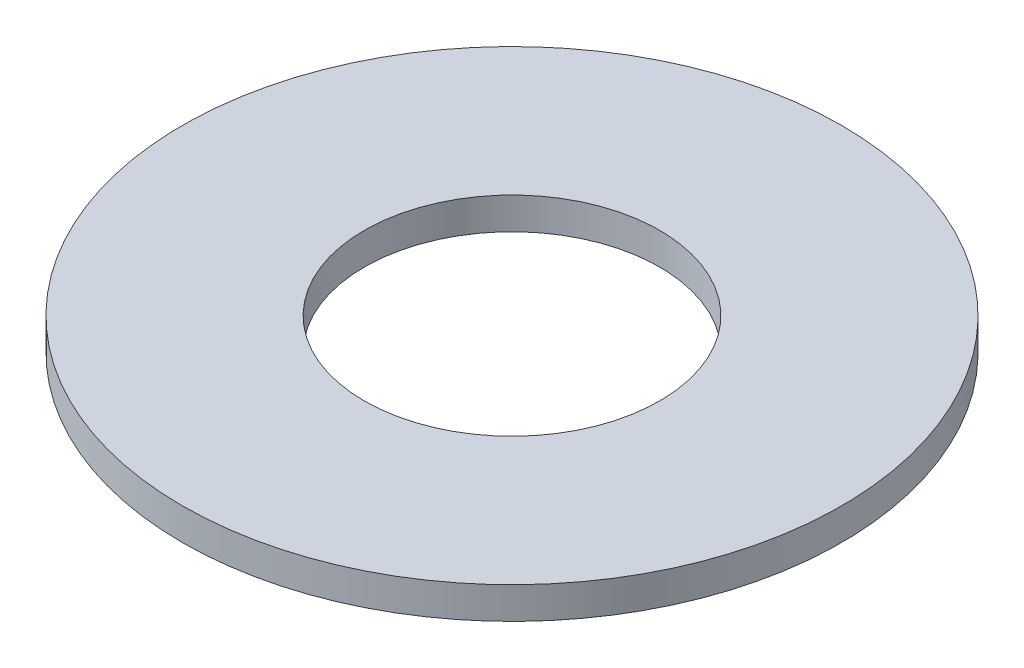
ISO-10303-21;
HEADER;
FILE_DESCRIPTION(('STEP AP214'),'2;1');
FILE_NAME('part.step','',(''),(''),'','','');
FILE_SCHEMA(('AUTOMOTIVE_DESIGN { 1 0 10303 214 1 1 1 1 }'));
ENDSEC;
DATA;
#1=APPLICATION_CONTEXT('core data for automotive mechanical design processes');
#2=APPLICATION_PROTOCOL_DEFINITION('international standard','automotive_design',2000,#1);
#3=PRODUCT_CONTEXT('',#1,'mechanical');
#4=PRODUCT('Part','Part','',(#3));
#5=PRODUCT_RELATED_PRODUCT_CATEGORY('part','',(#4));
#6=PRODUCT_DEFINITION_FORMATION('','',#4);
#7=PRODUCT_DEFINITION_CONTEXT('part definition',#1,'design');
#8=PRODUCT_DEFINITION('design','',#6,#7);
#9=PRODUCT_DEFINITION_SHAPE('','',#8);
#10=(LENGTH_UNIT() NAMED_UNIT(*) SI_UNIT(.MILLI.,.METRE.));
#11=(NAMED_UNIT(*) PLANE_ANGLE_UNIT() SI_UNIT($,.RADIAN.));
#12=(NAMED_UNIT(*) SI_UNIT($,.STERADIAN.) SOLID_ANGLE_UNIT());
#13=UNCERTAINTY_MEASURE_WITH_UNIT(LENGTH_MEASURE(1.E-05),#10,'distance_accuracy_value','');
#14=(GEOMETRIC_REPRESENTATION_CONTEXT(3) GLOBAL_UNCERTAINTY_ASSIGNED_CONTEXT((#13)) GLOBAL_UNIT_ASSIGNED_CONTEXT((#10,
#11,#12)) REPRESENTATION_CONTEXT('',''));
#15=CARTESIAN_POINT('',(0.,0.,0.));
#16=DIRECTION('',(0.,0.,1.));
#17=DIRECTION('',(1.,0.,0.));
#18=AXIS2_PLACEMENT_3D('',#15,#16,#17);
#19=CARTESIAN_POINT('',(0.,7.,0.));
#20=DIRECTION('',(0.,-1.,0.));
#21=DIRECTION('',(0.,0.,-1.));
#22=AXIS2_PLACEMENT_3D('',#19,#20,#21);
#23=CYLINDRICAL_SURFACE('',#22,72.5);
#24=CARTESIAN_POINT('',(0.,7.,0.));
#25=DIRECTION('',(0.,1.,0.));
#26=DIRECTION('',(0.,0.,1.));
#27=AXIS2_PLACEMENT_3D('',#24,#25,#26);
#28=CIRCLE('',#27,72.5);
#29=CARTESIAN_POINT('',(0.,7.,72.5));
#30=VERTEX_POINT('',#29);
#31=EDGE_CURVE('E10',#30,#30,#28,.T.);
#32=ORIENTED_EDGE('',*,*,#31,.F.);
#33=EDGE_LOOP('',(#32));
#34=FACE_BOUND('',#33,.T.);
#35=CARTESIAN_POINT('',(0.,0.,0.));
#36=DIRECTION('',(0.,1.,0.));
#37=DIRECTION('',(0.,0.,1.));
#38=AXIS2_PLACEMENT_3D('',#35,#36,#37);
#39=CIRCLE('',#38,72.5);
#40=CARTESIAN_POINT('',(0.,0.,72.5));
#41=VERTEX_POINT('',#40);
#42=EDGE_CURVE('E37',#41,#41,#39,.T.);
#43=ORIENTED_EDGE('',*,*,#42,.T.);
#44=EDGE_LOOP('',(#43));
#45=FACE_BOUND('',#44,.T.);
#46=ADVANCED_FACE('F40',(#34,#45),#23,.T.);
#47=CARTESIAN_POINT('',(0.,7.,0.));
#48=DIRECTION('',(0.,1.,0.));
#49=DIRECTION('',(0.,0.,1.));
#50=AXIS2_PLACEMENT_3D('',#47,#48,#49);
#51=PLANE('',#50);
#52=CARTESIAN_POINT('',(0.,7.,0.));
#53=DIRECTION('',(0.,1.,0.));
#54=DIRECTION('',(0.,0.,1.));
#55=AXIS2_PLACEMENT_3D('',#52,#53,#54);
#56=CIRCLE('',#55,32.5);
#57=CARTESIAN_POINT('',(0.,7.,32.5));
#58=VERTEX_POINT('',#57);
#59=EDGE_CURVE('E50',#58,#58,#56,.T.);
#60=ORIENTED_EDGE('',*,*,#59,.F.);
#61=EDGE_LOOP('',(#60));
#62=FACE_BOUND('',#61,.T.);
#63=ORIENTED_EDGE('',*,*,#31,.T.);
#64=EDGE_LOOP('',(#63));
#65=FACE_BOUND('',#64,.T.);
#66=ADVANCED_FACE('F59',(#62,#65),#51,.T.);
#67=CARTESIAN_POINT('',(0.,0.,0.));
#68=DIRECTION('',(0.,1.,0.));
#69=DIRECTION('',(0.,0.,1.));
#70=AXIS2_PLACEMENT_3D('',#67,#68,#69);
#71=PLANE('',#70);
#72=CARTESIAN_POINT('',(0.,0.,0.));
#73=DIRECTION('',(0.,1.,0.));
#74=DIRECTION('',(0.,0.,1.));
#75=AXIS2_PLACEMENT_3D('',#72,#73,#74);
#76=CIRCLE('',#75,32.5);
#77=CARTESIAN_POINT('',(0.,0.,32.5));
#78=VERTEX_POINT('',#77);
#79=EDGE_CURVE('E47',#78,#78,#76,.T.);
#80=ORIENTED_EDGE('',*,*,#79,.T.);
#81=EDGE_LOOP('',(#80));
#82=FACE_BOUND('',#81,.T.);
#83=ORIENTED_EDGE('',*,*,#42,.F.);
#84=EDGE_LOOP('',(#83));
#85=FACE_BOUND('',#84,.T.);
#86=ADVANCED_FACE('F58',(#82,#85),#71,.F.);
#87=CARTESIAN_POINT('',(0.,7.,0.));
#88=DIRECTION('',(0.,-1.,0.));
#89=DIRECTION('',(0.,0.,-1.));
#90=AXIS2_PLACEMENT_3D('',#87,#88,#89);
#91=CYLINDRICAL_SURFACE('',#90,32.5);
#92=ORIENTED_EDGE('',*,*,#59,.T.);
#93=EDGE_LOOP('',(#92));
#94=FACE_BOUND('',#93,.T.);
#95=ORIENTED_EDGE('',*,*,#79,.F.);
#96=EDGE_LOOP('',(#95));
#97=FACE_BOUND('',#96,.T.);
#98=ADVANCED_FACE('F54',(#94,#97),#91,.F.);
#99=CLOSED_SHELL('',(#46,#66,#86,#98));
#100=MANIFOLD_SOLID_BREP('B2',#99);
#101=ADVANCED_BREP_SHAPE_REPRESENTATION('',(#18,#100),#14);
#102=SHAPE_DEFINITION_REPRESENTATION(#9,#101);
ENDSEC;
END-ISO-10303-21;
